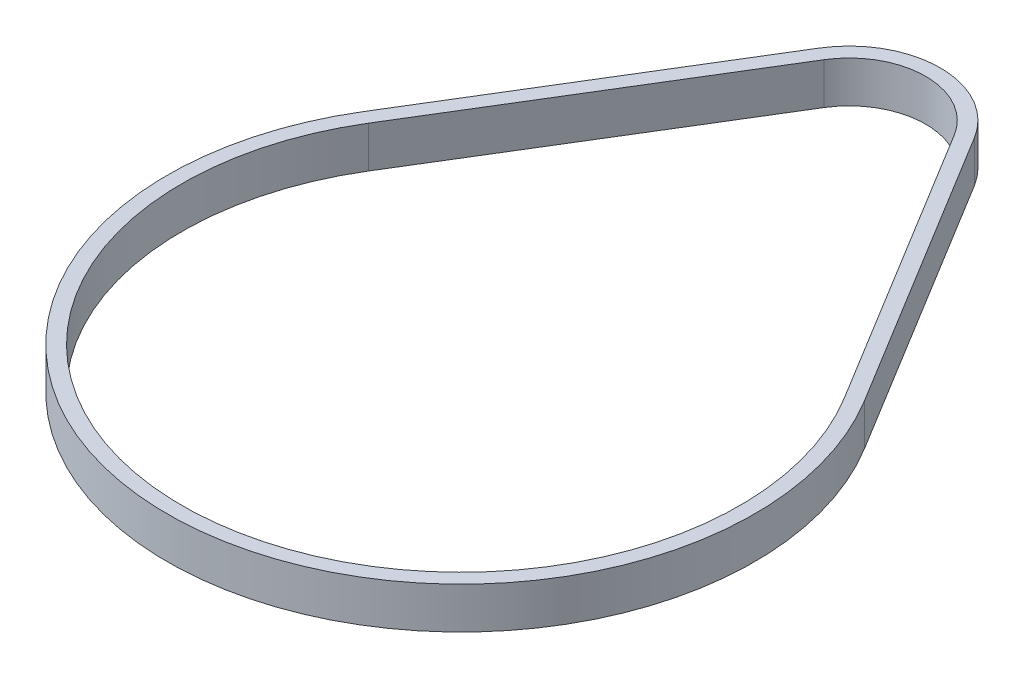
ISO-10303-21;
HEADER;
FILE_DESCRIPTION(('STEP AP214'),'2;1');
FILE_NAME('part.step','',(''),(''),'','','');
FILE_SCHEMA(('AUTOMOTIVE_DESIGN { 1 0 10303 214 1 1 1 1 }'));
ENDSEC;
DATA;
#1=APPLICATION_CONTEXT('core data for automotive mechanical design processes');
#2=APPLICATION_PROTOCOL_DEFINITION('international standard','automotive_design',2000,#1);
#3=PRODUCT_CONTEXT('',#1,'mechanical');
#4=PRODUCT('Part','Part','',(#3));
#5=PRODUCT_RELATED_PRODUCT_CATEGORY('part','',(#4));
#6=PRODUCT_DEFINITION_FORMATION('','',#4);
#7=PRODUCT_DEFINITION_CONTEXT('part definition',#1,'design');
#8=PRODUCT_DEFINITION('design','',#6,#7);
#9=PRODUCT_DEFINITION_SHAPE('','',#8);
#10=(LENGTH_UNIT() NAMED_UNIT(*) SI_UNIT(.MILLI.,.METRE.));
#11=(NAMED_UNIT(*) PLANE_ANGLE_UNIT() SI_UNIT($,.RADIAN.));
#12=(NAMED_UNIT(*) SI_UNIT($,.STERADIAN.) SOLID_ANGLE_UNIT());
#13=UNCERTAINTY_MEASURE_WITH_UNIT(LENGTH_MEASURE(1.E-05),#10,'distance_accuracy_value','');
#14=(GEOMETRIC_REPRESENTATION_CONTEXT(3) GLOBAL_UNCERTAINTY_ASSIGNED_CONTEXT((#13)) GLOBAL_UNIT_ASSIGNED_CONTEXT((#10,
#11,#12)) REPRESENTATION_CONTEXT('',''));
#15=CARTESIAN_POINT('',(0.,0.,0.));
#16=DIRECTION('',(0.,0.,1.));
#17=DIRECTION('',(1.,0.,0.));
#18=AXIS2_PLACEMENT_3D('',#15,#16,#17);
#19=CARTESIAN_POINT('',(0.,9.,0.));
#20=DIRECTION('',(0.,1.,0.));
#21=DIRECTION('',(0.,0.,1.));
#22=AXIS2_PLACEMENT_3D('',#19,#20,#21);
#23=PLANE('',#22);
#24=CARTESIAN_POINT('',(0.,9.,0.));
#25=DIRECTION('',(0.,1.,0.));
#26=DIRECTION('',(0.,0.,1.));
#27=AXIS2_PLACEMENT_3D('',#24,#25,#26);
#28=CIRCLE('',#27,63.7032);
#29=CARTESIAN_POINT('',(-54.3564662473416,9.,-33.2185530591207));
#30=VERTEX_POINT('',#29);
#31=CARTESIAN_POINT('',(54.3564662473416,9.,-33.2185530591207));
#32=VERTEX_POINT('',#31);
#33=EDGE_CURVE('E153',#30,#32,#28,.T.);
#34=ORIENTED_EDGE('',*,*,#33,.T.);
#35=DIRECTION('',(-0.521458153736715,0.,-0.853276856536902));
#36=VECTOR('',#35,1.);
#37=CARTESIAN_POINT('',(16.8617746173971,9.,-94.572186867622));
#38=LINE('',#37,#36);
#39=CARTESIAN_POINT('',(16.8617746173971,9.,-94.572186867622));
#40=VERTEX_POINT('',#39);
#41=EDGE_CURVE('E157',#32,#40,#38,.T.);
#42=ORIENTED_EDGE('',*,*,#41,.T.);
#43=CARTESIAN_POINT('',(0.,9.,-84.267548));
#44=DIRECTION('',(0.,1.,0.));
#45=DIRECTION('',(0.,0.,-1.));
#46=AXIS2_PLACEMENT_3D('',#43,#44,#45);
#47=CIRCLE('',#46,19.7612);
#48=CARTESIAN_POINT('',(-16.861774617397,9.,-94.572186867622));
#49=VERTEX_POINT('',#48);
#50=EDGE_CURVE('E161',#40,#49,#47,.T.);
#51=ORIENTED_EDGE('',*,*,#50,.T.);
#52=DIRECTION('',(-0.521458153736714,0.,0.853276856536902));
#53=VECTOR('',#52,1.);
#54=CARTESIAN_POINT('',(-54.3564662473416,9.,-33.2185530591207));
#55=LINE('',#54,#53);
#56=EDGE_CURVE('E164',#49,#30,#55,.T.);
#57=ORIENTED_EDGE('',*,*,#56,.T.);
#58=EDGE_LOOP('',(#34,#42,#51,#57));
#59=FACE_BOUND('',#58,.T.);
#60=DIRECTION('',(-0.521458153736715,0.,-0.853276856536902));
#61=VECTOR('',#60,1.);
#62=CARTESIAN_POINT('',(14.1526205978924,9.,-92.9165572295079));
#63=LINE('',#62,#61);
#64=CARTESIAN_POINT('',(51.6473122278369,9.,-31.5629234210066));
#65=VERTEX_POINT('',#64);
#66=CARTESIAN_POINT('',(14.1526205978924,9.,-92.9165572295079));
#67=VERTEX_POINT('',#66);
#68=EDGE_CURVE('E114',#65,#67,#63,.T.);
#69=ORIENTED_EDGE('',*,*,#68,.F.);
#70=CARTESIAN_POINT('',(0.,9.,0.));
#71=DIRECTION('',(0.,1.,0.));
#72=DIRECTION('',(0.,0.,1.));
#73=AXIS2_PLACEMENT_3D('',#70,#71,#72);
#74=CIRCLE('',#73,60.5282);
#75=CARTESIAN_POINT('',(-51.6473122278369,9.,-31.5629234210066));
#76=VERTEX_POINT('',#75);
#77=EDGE_CURVE('E105',#76,#65,#74,.T.);
#78=ORIENTED_EDGE('',*,*,#77,.F.);
#79=DIRECTION('',(-0.521458153736715,0.,0.853276856536902));
#80=VECTOR('',#79,1.);
#81=CARTESIAN_POINT('',(-51.6473122278369,9.,-31.5629234210066));
#82=LINE('',#81,#80);
#83=CARTESIAN_POINT('',(-14.1526205978924,9.,-92.9165572295079));
#84=VERTEX_POINT('',#83);
#85=EDGE_CURVE('E131',#84,#76,#82,.T.);
#86=ORIENTED_EDGE('',*,*,#85,.F.);
#87=CARTESIAN_POINT('',(0.,9.,-84.267548));
#88=DIRECTION('',(0.,1.,0.));
#89=DIRECTION('',(0.,0.,1.));
#90=AXIS2_PLACEMENT_3D('',#87,#88,#89);
#91=CIRCLE('',#90,16.5862);
#92=EDGE_CURVE('E127',#67,#84,#91,.T.);
#93=ORIENTED_EDGE('',*,*,#92,.F.);
#94=EDGE_LOOP('',(#69,#78,#86,#93));
#95=FACE_BOUND('',#94,.T.);
#96=ADVANCED_FACE('F39',(#59,#95),#23,.T.);
#97=CARTESIAN_POINT('',(0.,0.,0.));
#98=DIRECTION('',(0.,1.,0.));
#99=DIRECTION('',(0.,0.,1.));
#100=AXIS2_PLACEMENT_3D('',#97,#98,#99);
#101=PLANE('',#100);
#102=CARTESIAN_POINT('',(0.,0.,0.));
#103=DIRECTION('',(0.,1.,0.));
#104=DIRECTION('',(0.,0.,1.));
#105=AXIS2_PLACEMENT_3D('',#102,#103,#104);
#106=CIRCLE('',#105,63.7032);
#107=CARTESIAN_POINT('',(-54.3564662473416,0.,-33.2185530591207));
#108=VERTEX_POINT('',#107);
#109=CARTESIAN_POINT('',(54.3564662473416,0.,-33.2185530591207));
#110=VERTEX_POINT('',#109);
#111=EDGE_CURVE('E123',#108,#110,#106,.T.);
#112=ORIENTED_EDGE('',*,*,#111,.F.);
#113=DIRECTION('',(-0.521458153736714,0.,0.853276856536902));
#114=VECTOR('',#113,1.);
#115=CARTESIAN_POINT('',(-54.3564662473416,0.,-33.2185530591207));
#116=LINE('',#115,#114);
#117=CARTESIAN_POINT('',(-16.861774617397,0.,-94.572186867622));
#118=VERTEX_POINT('',#117);
#119=EDGE_CURVE('E158',#118,#108,#116,.T.);
#120=ORIENTED_EDGE('',*,*,#119,.F.);
#121=CARTESIAN_POINT('',(0.,0.,-84.267548));
#122=DIRECTION('',(0.,1.,0.));
#123=DIRECTION('',(0.,0.,-1.));
#124=AXIS2_PLACEMENT_3D('',#121,#122,#123);
#125=CIRCLE('',#124,19.7612);
#126=CARTESIAN_POINT('',(16.8617746173971,0.,-94.572186867622));
#127=VERTEX_POINT('',#126);
#128=EDGE_CURVE('E174',#127,#118,#125,.T.);
#129=ORIENTED_EDGE('',*,*,#128,.F.);
#130=DIRECTION('',(-0.521458153736715,0.,-0.853276856536902));
#131=VECTOR('',#130,1.);
#132=CARTESIAN_POINT('',(16.8617746173971,0.,-94.572186867622));
#133=LINE('',#132,#131);
#134=EDGE_CURVE('E171',#110,#127,#133,.T.);
#135=ORIENTED_EDGE('',*,*,#134,.F.);
#136=EDGE_LOOP('',(#112,#120,#129,#135));
#137=FACE_BOUND('',#136,.T.);
#138=CARTESIAN_POINT('',(0.,0.,0.));
#139=DIRECTION('',(0.,1.,0.));
#140=DIRECTION('',(0.,0.,1.));
#141=AXIS2_PLACEMENT_3D('',#138,#139,#140);
#142=CIRCLE('',#141,60.5282);
#143=CARTESIAN_POINT('',(-51.6473122278369,0.,-31.5629234210066));
#144=VERTEX_POINT('',#143);
#145=CARTESIAN_POINT('',(51.6473122278369,0.,-31.5629234210066));
#146=VERTEX_POINT('',#145);
#147=EDGE_CURVE('E63',#144,#146,#142,.T.);
#148=ORIENTED_EDGE('',*,*,#147,.T.);
#149=DIRECTION('',(-0.521458153736715,0.,-0.853276856536902));
#150=VECTOR('',#149,1.);
#151=CARTESIAN_POINT('',(14.1526205978924,0.,-92.9165572295079));
#152=LINE('',#151,#150);
#153=CARTESIAN_POINT('',(14.1526205978924,0.,-92.9165572295079));
#154=VERTEX_POINT('',#153);
#155=EDGE_CURVE('E121',#146,#154,#152,.T.);
#156=ORIENTED_EDGE('',*,*,#155,.T.);
#157=CARTESIAN_POINT('',(0.,0.,-84.267548));
#158=DIRECTION('',(0.,1.,0.));
#159=DIRECTION('',(0.,0.,1.));
#160=AXIS2_PLACEMENT_3D('',#157,#158,#159);
#161=CIRCLE('',#160,16.5862);
#162=CARTESIAN_POINT('',(-14.1526205978924,0.,-92.9165572295079));
#163=VERTEX_POINT('',#162);
#164=EDGE_CURVE('E140',#154,#163,#161,.T.);
#165=ORIENTED_EDGE('',*,*,#164,.T.);
#166=DIRECTION('',(-0.521458153736715,0.,0.853276856536902));
#167=VECTOR('',#166,1.);
#168=CARTESIAN_POINT('',(-51.6473122278369,0.,-31.5629234210066));
#169=LINE('',#168,#167);
#170=EDGE_CURVE('E115',#163,#144,#169,.T.);
#171=ORIENTED_EDGE('',*,*,#170,.T.);
#172=EDGE_LOOP('',(#148,#156,#165,#171));
#173=FACE_BOUND('',#172,.T.);
#174=ADVANCED_FACE('F197',(#137,#173),#101,.F.);
#175=CARTESIAN_POINT('',(0.,9.,0.));
#176=DIRECTION('',(0.,-1.,0.));
#177=DIRECTION('',(0.,0.,-1.));
#178=AXIS2_PLACEMENT_3D('',#175,#176,#177);
#179=CYLINDRICAL_SURFACE('',#178,63.7032);
#180=ORIENTED_EDGE('',*,*,#111,.T.);
#181=DIRECTION('',(0.,-1.,0.));
#182=VECTOR('',#181,1.);
#183=CARTESIAN_POINT('',(54.3564662473416,9.,-33.2185530591207));
#184=LINE('',#183,#182);
#185=EDGE_CURVE('E11',#32,#110,#184,.T.);
#186=ORIENTED_EDGE('',*,*,#185,.F.);
#187=ORIENTED_EDGE('',*,*,#33,.F.);
#188=DIRECTION('',(0.,-1.,0.));
#189=VECTOR('',#188,1.);
#190=CARTESIAN_POINT('',(-54.3564662473416,9.,-33.2185530591207));
#191=LINE('',#190,#189);
#192=EDGE_CURVE('E167',#30,#108,#191,.T.);
#193=ORIENTED_EDGE('',*,*,#192,.T.);
#194=EDGE_LOOP('',(#180,#186,#187,#193));
#195=FACE_BOUND('',#194,.T.);
#196=ADVANCED_FACE('F41',(#195),#179,.T.);
#197=CARTESIAN_POINT('',(16.8617746173971,9.,-94.572186867622));
#198=DIRECTION('',(-0.853276856536902,0.,0.521458153736715));
#199=DIRECTION('',(0.521458153736715,0.,0.853276856536902));
#200=AXIS2_PLACEMENT_3D('',#197,#198,#199);
#201=PLANE('',#200);
#202=ORIENTED_EDGE('',*,*,#134,.T.);
#203=DIRECTION('',(0.,-1.,0.));
#204=VECTOR('',#203,1.);
#205=CARTESIAN_POINT('',(16.8617746173971,9.,-94.572186867622));
#206=LINE('',#205,#204);
#207=EDGE_CURVE('E48',#40,#127,#206,.T.);
#208=ORIENTED_EDGE('',*,*,#207,.F.);
#209=ORIENTED_EDGE('',*,*,#41,.F.);
#210=ORIENTED_EDGE('',*,*,#185,.T.);
#211=EDGE_LOOP('',(#202,#208,#209,#210));
#212=FACE_BOUND('',#211,.T.);
#213=ADVANCED_FACE('F207',(#212),#201,.F.);
#214=CARTESIAN_POINT('',(0.,9.,-84.267548));
#215=DIRECTION('',(0.,-1.,0.));
#216=DIRECTION('',(0.,0.,-1.));
#217=AXIS2_PLACEMENT_3D('',#214,#215,#216);
#218=CYLINDRICAL_SURFACE('',#217,19.7612);
#219=ORIENTED_EDGE('',*,*,#128,.T.);
#220=DIRECTION('',(0.,-1.,0.));
#221=VECTOR('',#220,1.);
#222=CARTESIAN_POINT('',(-16.861774617397,9.,-94.572186867622));
#223=LINE('',#222,#221);
#224=EDGE_CURVE('E182',#49,#118,#223,.T.);
#225=ORIENTED_EDGE('',*,*,#224,.F.);
#226=ORIENTED_EDGE('',*,*,#50,.F.);
#227=ORIENTED_EDGE('',*,*,#207,.T.);
#228=EDGE_LOOP('',(#219,#225,#226,#227));
#229=FACE_BOUND('',#228,.T.);
#230=ADVANCED_FACE('F191',(#229),#218,.T.);
#231=CARTESIAN_POINT('',(-54.3564662473416,9.,-33.2185530591207));
#232=DIRECTION('',(0.853276856536902,0.,0.521458153736714));
#233=DIRECTION('',(0.521458153736714,0.,-0.853276856536902));
#234=AXIS2_PLACEMENT_3D('',#231,#232,#233);
#235=PLANE('',#234);
#236=ORIENTED_EDGE('',*,*,#119,.T.);
#237=ORIENTED_EDGE('',*,*,#192,.F.);
#238=ORIENTED_EDGE('',*,*,#56,.F.);
#239=ORIENTED_EDGE('',*,*,#224,.T.);
#240=EDGE_LOOP('',(#236,#237,#238,#239));
#241=FACE_BOUND('',#240,.T.);
#242=ADVANCED_FACE('F201',(#241),#235,.F.);
#243=CARTESIAN_POINT('',(0.,9.,0.));
#244=DIRECTION('',(0.,-1.,0.));
#245=DIRECTION('',(0.,0.,-1.));
#246=AXIS2_PLACEMENT_3D('',#243,#244,#245);
#247=CYLINDRICAL_SURFACE('',#246,60.5282);
#248=ORIENTED_EDGE('',*,*,#147,.F.);
#249=DIRECTION('',(0.,-1.,0.));
#250=VECTOR('',#249,1.);
#251=CARTESIAN_POINT('',(-51.6473122278369,9.,-31.5629234210066));
#252=LINE('',#251,#250);
#253=EDGE_CURVE('E109',#76,#144,#252,.T.);
#254=ORIENTED_EDGE('',*,*,#253,.F.);
#255=ORIENTED_EDGE('',*,*,#77,.T.);
#256=DIRECTION('',(0.,-1.,0.));
#257=VECTOR('',#256,1.);
#258=CARTESIAN_POINT('',(51.6473122278369,9.,-31.5629234210066));
#259=LINE('',#258,#257);
#260=EDGE_CURVE('E108',#65,#146,#259,.T.);
#261=ORIENTED_EDGE('',*,*,#260,.T.);
#262=EDGE_LOOP('',(#248,#254,#255,#261));
#263=FACE_BOUND('',#262,.T.);
#264=ADVANCED_FACE('F107',(#263),#247,.F.);
#265=CARTESIAN_POINT('',(14.1526205978924,9.,-92.9165572295079));
#266=DIRECTION('',(-0.853276856536902,0.,0.521458153736715));
#267=DIRECTION('',(0.521458153736715,0.,0.853276856536902));
#268=AXIS2_PLACEMENT_3D('',#265,#266,#267);
#269=PLANE('',#268);
#270=ORIENTED_EDGE('',*,*,#155,.F.);
#271=ORIENTED_EDGE('',*,*,#260,.F.);
#272=ORIENTED_EDGE('',*,*,#68,.T.);
#273=DIRECTION('',(0.,-1.,0.));
#274=VECTOR('',#273,1.);
#275=CARTESIAN_POINT('',(14.1526205978924,9.,-92.9165572295079));
#276=LINE('',#275,#274);
#277=EDGE_CURVE('E124',#67,#154,#276,.T.);
#278=ORIENTED_EDGE('',*,*,#277,.T.);
#279=EDGE_LOOP('',(#270,#271,#272,#278));
#280=FACE_BOUND('',#279,.T.);
#281=ADVANCED_FACE('F118',(#280),#269,.T.);
#282=CARTESIAN_POINT('',(0.,9.,-84.267548));
#283=DIRECTION('',(0.,-1.,0.));
#284=DIRECTION('',(0.,0.,-1.));
#285=AXIS2_PLACEMENT_3D('',#282,#283,#284);
#286=CYLINDRICAL_SURFACE('',#285,16.5862);
#287=ORIENTED_EDGE('',*,*,#164,.F.);
#288=ORIENTED_EDGE('',*,*,#277,.F.);
#289=ORIENTED_EDGE('',*,*,#92,.T.);
#290=DIRECTION('',(0.,-1.,0.));
#291=VECTOR('',#290,1.);
#292=CARTESIAN_POINT('',(-14.1526205978924,9.,-92.9165572295079));
#293=LINE('',#292,#291);
#294=EDGE_CURVE('E55',#84,#163,#293,.T.);
#295=ORIENTED_EDGE('',*,*,#294,.T.);
#296=EDGE_LOOP('',(#287,#288,#289,#295));
#297=FACE_BOUND('',#296,.T.);
#298=ADVANCED_FACE('F230',(#297),#286,.F.);
#299=CARTESIAN_POINT('',(-51.6473122278369,9.,-31.5629234210066));
#300=DIRECTION('',(0.853276856536902,0.,0.521458153736715));
#301=DIRECTION('',(0.521458153736715,0.,-0.853276856536902));
#302=AXIS2_PLACEMENT_3D('',#299,#300,#301);
#303=PLANE('',#302);
#304=ORIENTED_EDGE('',*,*,#170,.F.);
#305=ORIENTED_EDGE('',*,*,#294,.F.);
#306=ORIENTED_EDGE('',*,*,#85,.T.);
#307=ORIENTED_EDGE('',*,*,#253,.T.);
#308=EDGE_LOOP('',(#304,#305,#306,#307));
#309=FACE_BOUND('',#308,.T.);
#310=ADVANCED_FACE('F234',(#309),#303,.T.);
#311=CLOSED_SHELL('',(#96,#174,#196,#213,#230,#242,#264,#281,#298,#310));
#312=MANIFOLD_SOLID_BREP('B2',#311);
#313=ADVANCED_BREP_SHAPE_REPRESENTATION('',(#18,#312),#14);
#314=SHAPE_DEFINITION_REPRESENTATION(#9,#313);
ENDSEC;
END-ISO-10303-21;
